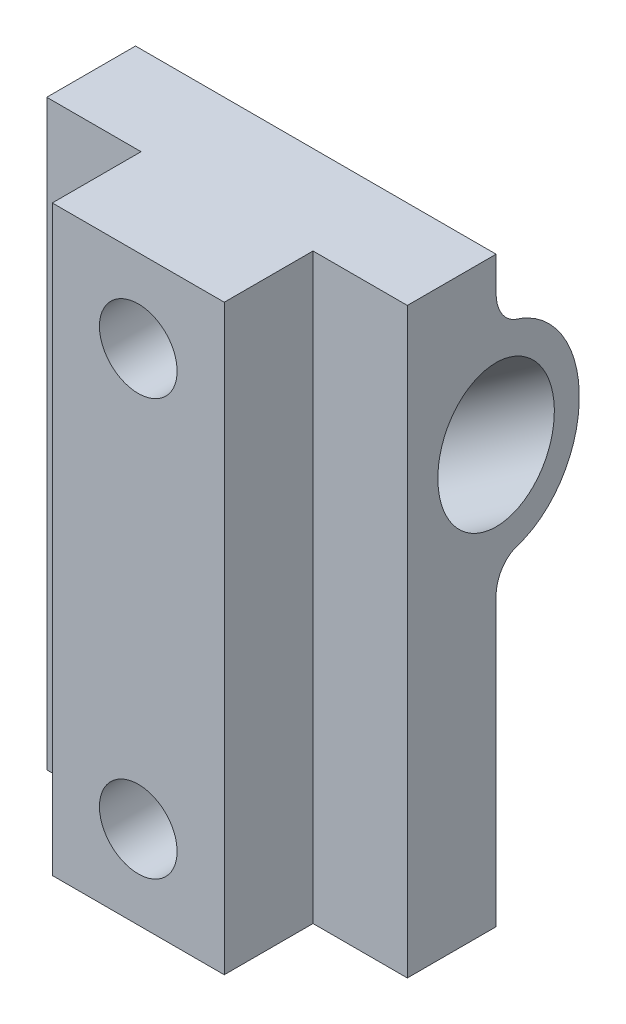
ISO-10303-21;
HEADER;
FILE_DESCRIPTION(('STEP AP214'),'2;1');
FILE_NAME('part.step','',(''),(''),'','','');
FILE_SCHEMA(('AUTOMOTIVE_DESIGN { 1 0 10303 214 1 1 1 1 }'));
ENDSEC;
DATA;
#1=APPLICATION_CONTEXT('core data for automotive mechanical design processes');
#2=APPLICATION_PROTOCOL_DEFINITION('international standard','automotive_design',2000,#1);
#3=PRODUCT_CONTEXT('',#1,'mechanical');
#4=PRODUCT('Part','Part','',(#3));
#5=PRODUCT_RELATED_PRODUCT_CATEGORY('part','',(#4));
#6=PRODUCT_DEFINITION_FORMATION('','',#4);
#7=PRODUCT_DEFINITION_CONTEXT('part definition',#1,'design');
#8=PRODUCT_DEFINITION('design','',#6,#7);
#9=PRODUCT_DEFINITION_SHAPE('','',#8);
#10=(LENGTH_UNIT() NAMED_UNIT(*) SI_UNIT(.MILLI.,.METRE.));
#11=(NAMED_UNIT(*) PLANE_ANGLE_UNIT() SI_UNIT($,.RADIAN.));
#12=(NAMED_UNIT(*) SI_UNIT($,.STERADIAN.) SOLID_ANGLE_UNIT());
#13=UNCERTAINTY_MEASURE_WITH_UNIT(LENGTH_MEASURE(1.E-05),#10,'distance_accuracy_value','');
#14=(GEOMETRIC_REPRESENTATION_CONTEXT(3) GLOBAL_UNCERTAINTY_ASSIGNED_CONTEXT((#13)) GLOBAL_UNIT_ASSIGNED_CONTEXT((#10,
#11,#12)) REPRESENTATION_CONTEXT('',''));
#15=CARTESIAN_POINT('',(0.,0.,0.));
#16=DIRECTION('',(0.,0.,1.));
#17=DIRECTION('',(1.,0.,0.));
#18=AXIS2_PLACEMENT_3D('',#15,#16,#17);
#19=CARTESIAN_POINT('',(0.,105.,-8.));
#20=DIRECTION('',(0.,0.,-1.));
#21=DIRECTION('',(-1.,0.,0.));
#22=AXIS2_PLACEMENT_3D('',#19,#20,#21);
#23=PLANE('',#22);
#24=CARTESIAN_POINT('',(0.,90.,-8.));
#25=DIRECTION('',(0.,0.,-1.));
#26=DIRECTION('',(-1.,0.,0.));
#27=AXIS2_PLACEMENT_3D('',#24,#25,#26);
#28=CIRCLE('',#27,7.);
#29=CARTESIAN_POINT('',(-7.00000000000001,90.,-8.));
#30=VERTEX_POINT('',#29);
#31=EDGE_CURVE('E264',#30,#30,#28,.T.);
#32=ORIENTED_EDGE('',*,*,#31,.F.);
#33=EDGE_LOOP('',(#32));
#34=FACE_BOUND('',#33,.T.);
#35=DIRECTION('',(0.,-1.,0.));
#36=VECTOR('',#35,1.);
#37=CARTESIAN_POINT('',(32.5,105.,-8.));
#38=LINE('',#37,#36);
#39=CARTESIAN_POINT('',(32.5,105.,-8.));
#40=VERTEX_POINT('',#39);
#41=CARTESIAN_POINT('',(32.5,98.8969432505473,-8.));
#42=VERTEX_POINT('',#41);
#43=EDGE_CURVE('E184',#40,#42,#38,.T.);
#44=ORIENTED_EDGE('',*,*,#43,.T.);
#45=DIRECTION('',(0.819152044288991,0.573576436351047,0.));
#46=VECTOR('',#45,1.);
#47=CARTESIAN_POINT('',(13.5596713668071,85.6347823654164,-8.));
#48=LINE('',#47,#46);
#49=CARTESIAN_POINT('',(-32.5,53.383453266916,-7.99999999999999));
#50=VERTEX_POINT('',#49);
#51=EDGE_CURVE('E259',#42,#50,#48,.F.);
#52=ORIENTED_EDGE('',*,*,#51,.T.);
#53=DIRECTION('',(0.,-1.,0.));
#54=VECTOR('',#53,1.);
#55=CARTESIAN_POINT('',(-32.5,105.,-7.99999999999999));
#56=LINE('',#55,#54);
#57=CARTESIAN_POINT('',(-32.5,105.,-7.99999999999999));
#58=VERTEX_POINT('',#57);
#59=EDGE_CURVE('E220',#58,#50,#56,.T.);
#60=ORIENTED_EDGE('',*,*,#59,.F.);
#61=DIRECTION('',(1.,0.,0.));
#62=VECTOR('',#61,1.);
#63=CARTESIAN_POINT('',(0.,105.,-8.));
#64=LINE('',#63,#62);
#65=EDGE_CURVE('E191',#58,#40,#64,.T.);
#66=ORIENTED_EDGE('',*,*,#65,.T.);
#67=EDGE_LOOP('',(#44,#52,#60,#66));
#68=FACE_BOUND('',#67,.T.);
#69=ADVANCED_FACE('F71',(#34,#68),#23,.T.);
#70=CARTESIAN_POINT('',(0.,15.,-8.));
#71=DIRECTION('',(0.,0.,-1.));
#72=DIRECTION('',(1.,0.,0.));
#73=AXIS2_PLACEMENT_3D('',#70,#71,#72);
#74=CIRCLE('',#73,7.);
#75=CARTESIAN_POINT('',(6.99999999999999,15.,-8.));
#76=VERTEX_POINT('',#75);
#77=EDGE_CURVE('E326',#76,#76,#74,.T.);
#78=ORIENTED_EDGE('',*,*,#77,.F.);
#79=EDGE_LOOP('',(#78));
#80=FACE_BOUND('',#79,.T.);
#81=CARTESIAN_POINT('',(-32.5,6.1030567494527,-7.99999999999999));
#82=VERTEX_POINT('',#81);
#83=CARTESIAN_POINT('',(-32.5,0.,-7.99999999999999));
#84=VERTEX_POINT('',#83);
#85=EDGE_CURVE('E219',#82,#84,#56,.T.);
#86=ORIENTED_EDGE('',*,*,#85,.F.);
#87=DIRECTION('',(0.819152044288991,0.573576436351047,0.));
#88=VECTOR('',#87,1.);
#89=CARTESIAN_POINT('',(35.7741912244531,53.9091601099861,-8.00000000000001));
#90=LINE('',#89,#88);
#91=CARTESIAN_POINT('',(32.5,51.616546733084,-8.));
#92=VERTEX_POINT('',#91);
#93=EDGE_CURVE('E277',#82,#92,#90,.T.);
#94=ORIENTED_EDGE('',*,*,#93,.T.);
#95=CARTESIAN_POINT('',(32.5,0.,-8.));
#96=VERTEX_POINT('',#95);
#97=EDGE_CURVE('E224',#92,#96,#38,.T.);
#98=ORIENTED_EDGE('',*,*,#97,.T.);
#99=DIRECTION('',(1.,0.,0.));
#100=VECTOR('',#99,1.);
#101=CARTESIAN_POINT('',(0.,0.,-8.));
#102=LINE('',#101,#100);
#103=EDGE_CURVE('E210',#84,#96,#102,.T.);
#104=ORIENTED_EDGE('',*,*,#103,.F.);
#105=EDGE_LOOP('',(#86,#94,#98,#104));
#106=FACE_BOUND('',#105,.T.);
#107=ADVANCED_FACE('F298',(#80,#106),#23,.T.);
#108=CARTESIAN_POINT('',(32.5,105.,0.));
#109=DIRECTION('',(1.,0.,0.));
#110=DIRECTION('',(0.,0.,-1.));
#111=AXIS2_PLACEMENT_3D('',#108,#109,#110);
#112=PLANE('',#111);
#113=CARTESIAN_POINT('',(32.5,75.2567449918156,-7.99999999999999));
#114=DIRECTION('',(1.,0.,0.));
#115=DIRECTION('',(0.,-1.,0.));
#116=AXIS2_PLACEMENT_3D('',#113,#114,#115);
#117=ELLIPSE('',#116,12.8181331819953,10.5);
#118=CARTESIAN_POINT('',(32.5,62.4386118098203,-8.00000000000001));
#119=VERTEX_POINT('',#118);
#120=EDGE_CURVE('E295',#119,#119,#117,.F.);
#121=ORIENTED_EDGE('',*,*,#120,.T.);
#122=EDGE_LOOP('',(#121));
#123=FACE_BOUND('',#122,.T.);
#124=ORIENTED_EDGE('',*,*,#97,.F.);
#125=CARTESIAN_POINT('',(32.5,51.616546733084,-13.));
#126=DIRECTION('',(1.,0.,0.));
#127=DIRECTION('',(0.,1.,0.));
#128=AXIS2_PLACEMENT_3D('',#125,#126,#127);
#129=ELLIPSE('',#128,6.10387294380729,5.);
#130=CARTESIAN_POINT('',(32.5,57.5265962977669,-11.75));
#131=VERTEX_POINT('',#130);
#132=EDGE_CURVE('E80',#92,#131,#129,.F.);
#133=ORIENTED_EDGE('',*,*,#132,.T.);
#134=CARTESIAN_POINT('',(32.5,75.2567449918156,-7.99999999999999));
#135=DIRECTION('',(1.,0.,0.));
#136=DIRECTION('',(0.,-1.,0.));
#137=AXIS2_PLACEMENT_3D('',#134,#135,#136);
#138=ELLIPSE('',#137,18.3116188314219,15.);
#139=CARTESIAN_POINT('',(32.5,92.9868936858644,-11.75));
#140=VERTEX_POINT('',#139);
#141=EDGE_CURVE('E288',#140,#131,#138,.F.);
#142=ORIENTED_EDGE('',*,*,#141,.F.);
#143=CARTESIAN_POINT('',(32.5,98.8969432505473,-13.));
#144=DIRECTION('',(1.,0.,0.));
#145=DIRECTION('',(0.,1.,0.));
#146=AXIS2_PLACEMENT_3D('',#143,#144,#145);
#147=ELLIPSE('',#146,6.10387294380729,5.);
#148=EDGE_CURVE('E283',#140,#42,#147,.F.);
#149=ORIENTED_EDGE('',*,*,#148,.T.);
#150=ORIENTED_EDGE('',*,*,#43,.F.);
#151=DIRECTION('',(0.,0.,1.));
#152=VECTOR('',#151,1.);
#153=CARTESIAN_POINT('',(32.5,105.,0.));
#154=LINE('',#153,#152);
#155=CARTESIAN_POINT('',(32.5,105.,8.));
#156=VERTEX_POINT('',#155);
#157=EDGE_CURVE('E166',#40,#156,#154,.T.);
#158=ORIENTED_EDGE('',*,*,#157,.T.);
#159=DIRECTION('',(0.,-1.,0.));
#160=VECTOR('',#159,1.);
#161=CARTESIAN_POINT('',(32.5,105.,8.));
#162=LINE('',#161,#160);
#163=CARTESIAN_POINT('',(32.5,0.,8.));
#164=VERTEX_POINT('',#163);
#165=EDGE_CURVE('E175',#156,#164,#162,.T.);
#166=ORIENTED_EDGE('',*,*,#165,.T.);
#167=DIRECTION('',(0.,0.,1.));
#168=VECTOR('',#167,1.);
#169=CARTESIAN_POINT('',(32.5,0.,0.));
#170=LINE('',#169,#168);
#171=EDGE_CURVE('E207',#96,#164,#170,.T.);
#172=ORIENTED_EDGE('',*,*,#171,.F.);
#173=EDGE_LOOP('',(#124,#133,#142,#149,#150,#158,#166,#172));
#174=FACE_BOUND('',#173,.T.);
#175=ADVANCED_FACE('F188',(#123,#174),#112,.T.);
#176=CARTESIAN_POINT('',(0.,105.,8.));
#177=DIRECTION('',(0.,0.,-1.));
#178=DIRECTION('',(-1.,0.,0.));
#179=AXIS2_PLACEMENT_3D('',#176,#177,#178);
#180=PLANE('',#179);
#181=DIRECTION('',(1.,0.,0.));
#182=VECTOR('',#181,1.);
#183=CARTESIAN_POINT('',(0.,105.,8.));
#184=LINE('',#183,#182);
#185=CARTESIAN_POINT('',(15.5,105.,8.));
#186=VERTEX_POINT('',#185);
#187=EDGE_CURVE('E161',#186,#156,#184,.T.);
#188=ORIENTED_EDGE('',*,*,#187,.F.);
#189=DIRECTION('',(0.,-1.,0.));
#190=VECTOR('',#189,1.);
#191=CARTESIAN_POINT('',(15.5,105.,8.));
#192=LINE('',#191,#190);
#193=CARTESIAN_POINT('',(15.5,0.,8.));
#194=VERTEX_POINT('',#193);
#195=EDGE_CURVE('E183',#186,#194,#192,.T.);
#196=ORIENTED_EDGE('',*,*,#195,.T.);
#197=DIRECTION('',(1.,0.,0.));
#198=VECTOR('',#197,1.);
#199=CARTESIAN_POINT('',(0.,0.,8.));
#200=LINE('',#199,#198);
#201=EDGE_CURVE('E178',#194,#164,#200,.T.);
#202=ORIENTED_EDGE('',*,*,#201,.T.);
#203=ORIENTED_EDGE('',*,*,#165,.F.);
#204=EDGE_LOOP('',(#188,#196,#202,#203));
#205=FACE_BOUND('',#204,.T.);
#206=ADVANCED_FACE('F176',(#205),#180,.F.);
#207=CARTESIAN_POINT('',(0.,0.,0.));
#208=DIRECTION('',(0.,1.,0.));
#209=DIRECTION('',(0.,0.,1.));
#210=AXIS2_PLACEMENT_3D('',#207,#208,#209);
#211=PLANE('',#210);
#212=ORIENTED_EDGE('',*,*,#201,.F.);
#213=DIRECTION('',(0.,0.,1.));
#214=VECTOR('',#213,1.);
#215=CARTESIAN_POINT('',(15.5,0.,-8.));
#216=LINE('',#215,#214);
#217=CARTESIAN_POINT('',(15.5,0.,24.));
#218=VERTEX_POINT('',#217);
#219=EDGE_CURVE('E231',#194,#218,#216,.T.);
#220=ORIENTED_EDGE('',*,*,#219,.T.);
#221=DIRECTION('',(1.,0.,0.));
#222=VECTOR('',#221,1.);
#223=CARTESIAN_POINT('',(-15.5,0.,24.));
#224=LINE('',#223,#222);
#225=CARTESIAN_POINT('',(-15.5,0.,24.));
#226=VERTEX_POINT('',#225);
#227=EDGE_CURVE('E240',#226,#218,#224,.T.);
#228=ORIENTED_EDGE('',*,*,#227,.F.);
#229=DIRECTION('',(0.,0.,1.));
#230=VECTOR('',#229,1.);
#231=CARTESIAN_POINT('',(-15.5,0.,-8.));
#232=LINE('',#231,#230);
#233=CARTESIAN_POINT('',(-15.5,0.,8.00000000000001));
#234=VERTEX_POINT('',#233);
#235=EDGE_CURVE('E237',#234,#226,#232,.T.);
#236=ORIENTED_EDGE('',*,*,#235,.F.);
#237=CARTESIAN_POINT('',(-32.5,0.,8.00000000000001));
#238=VERTEX_POINT('',#237);
#239=EDGE_CURVE('E203',#238,#234,#200,.T.);
#240=ORIENTED_EDGE('',*,*,#239,.F.);
#241=DIRECTION('',(0.,0.,1.));
#242=VECTOR('',#241,1.);
#243=CARTESIAN_POINT('',(-32.5,0.,0.));
#244=LINE('',#243,#242);
#245=EDGE_CURVE('E172',#84,#238,#244,.T.);
#246=ORIENTED_EDGE('',*,*,#245,.F.);
#247=ORIENTED_EDGE('',*,*,#103,.T.);
#248=ORIENTED_EDGE('',*,*,#171,.T.);
#249=EDGE_LOOP('',(#212,#220,#228,#236,#240,#246,#247,#248));
#250=FACE_BOUND('',#249,.T.);
#251=ADVANCED_FACE('F307',(#250),#211,.F.);
#252=CARTESIAN_POINT('',(0.,105.,0.));
#253=DIRECTION('',(0.,1.,0.));
#254=DIRECTION('',(0.,0.,1.));
#255=AXIS2_PLACEMENT_3D('',#252,#253,#254);
#256=PLANE('',#255);
#257=ORIENTED_EDGE('',*,*,#157,.F.);
#258=ORIENTED_EDGE('',*,*,#65,.F.);
#259=DIRECTION('',(0.,0.,1.));
#260=VECTOR('',#259,1.);
#261=CARTESIAN_POINT('',(-32.5,105.,0.));
#262=LINE('',#261,#260);
#263=CARTESIAN_POINT('',(-32.5,105.,8.00000000000001));
#264=VERTEX_POINT('',#263);
#265=EDGE_CURVE('E195',#58,#264,#262,.T.);
#266=ORIENTED_EDGE('',*,*,#265,.T.);
#267=CARTESIAN_POINT('',(-15.5,105.,8.00000000000001));
#268=VERTEX_POINT('',#267);
#269=EDGE_CURVE('E171',#264,#268,#184,.T.);
#270=ORIENTED_EDGE('',*,*,#269,.T.);
#271=DIRECTION('',(0.,0.,1.));
#272=VECTOR('',#271,1.);
#273=CARTESIAN_POINT('',(-15.5,105.,-8.));
#274=LINE('',#273,#272);
#275=CARTESIAN_POINT('',(-15.5,105.,24.));
#276=VERTEX_POINT('',#275);
#277=EDGE_CURVE('E227',#268,#276,#274,.T.);
#278=ORIENTED_EDGE('',*,*,#277,.T.);
#279=DIRECTION('',(1.,0.,0.));
#280=VECTOR('',#279,1.);
#281=CARTESIAN_POINT('',(-15.5,105.,24.));
#282=LINE('',#281,#280);
#283=CARTESIAN_POINT('',(15.5,105.,24.));
#284=VERTEX_POINT('',#283);
#285=EDGE_CURVE('E230',#276,#284,#282,.T.);
#286=ORIENTED_EDGE('',*,*,#285,.T.);
#287=DIRECTION('',(0.,0.,1.));
#288=VECTOR('',#287,1.);
#289=CARTESIAN_POINT('',(15.5,105.,-8.));
#290=LINE('',#289,#288);
#291=EDGE_CURVE('E168',#186,#284,#290,.T.);
#292=ORIENTED_EDGE('',*,*,#291,.F.);
#293=ORIENTED_EDGE('',*,*,#187,.T.);
#294=EDGE_LOOP('',(#257,#258,#266,#270,#278,#286,#292,#293));
#295=FACE_BOUND('',#294,.T.);
#296=ADVANCED_FACE('F163',(#295),#256,.T.);
#297=CARTESIAN_POINT('',(-32.5,105.,0.));
#298=DIRECTION('',(1.,0.,0.));
#299=DIRECTION('',(0.,0.,-1.));
#300=AXIS2_PLACEMENT_3D('',#297,#298,#299);
#301=PLANE('',#300);
#302=CARTESIAN_POINT('',(-32.5,29.7432550081844,-7.99999999999999));
#303=DIRECTION('',(1.,0.,0.));
#304=DIRECTION('',(0.,1.,0.));
#305=AXIS2_PLACEMENT_3D('',#302,#303,#304);
#306=ELLIPSE('',#305,12.8181331819953,10.5);
#307=CARTESIAN_POINT('',(-32.5,42.5613881901797,-7.99999999999999));
#308=VERTEX_POINT('',#307);
#309=EDGE_CURVE('E321',#308,#308,#306,.T.);
#310=ORIENTED_EDGE('',*,*,#309,.T.);
#311=EDGE_LOOP('',(#310));
#312=FACE_BOUND('',#311,.T.);
#313=ORIENTED_EDGE('',*,*,#59,.T.);
#314=CARTESIAN_POINT('',(-32.5,53.383453266916,-13.));
#315=DIRECTION('',(1.,0.,0.));
#316=DIRECTION('',(0.,1.,0.));
#317=AXIS2_PLACEMENT_3D('',#314,#315,#316);
#318=ELLIPSE('',#317,6.10387294380729,5.);
#319=CARTESIAN_POINT('',(-32.5,47.4734037022331,-11.75));
#320=VERTEX_POINT('',#319);
#321=EDGE_CURVE('E280',#50,#320,#318,.T.);
#322=ORIENTED_EDGE('',*,*,#321,.T.);
#323=CARTESIAN_POINT('',(-32.5,29.7432550081844,-7.99999999999999));
#324=DIRECTION('',(1.,0.,0.));
#325=DIRECTION('',(0.,1.,0.));
#326=AXIS2_PLACEMENT_3D('',#323,#324,#325);
#327=ELLIPSE('',#326,18.3116188314219,15.);
#328=CARTESIAN_POINT('',(-32.5,12.0131063141356,-11.75));
#329=VERTEX_POINT('',#328);
#330=EDGE_CURVE('E319',#329,#320,#327,.T.);
#331=ORIENTED_EDGE('',*,*,#330,.F.);
#332=CARTESIAN_POINT('',(-32.5,6.10305674945269,-13.));
#333=DIRECTION('',(1.,0.,0.));
#334=DIRECTION('',(0.,1.,0.));
#335=AXIS2_PLACEMENT_3D('',#332,#333,#334);
#336=ELLIPSE('',#335,6.10387294380729,5.);
#337=EDGE_CURVE('E12',#329,#82,#336,.T.);
#338=ORIENTED_EDGE('',*,*,#337,.T.);
#339=ORIENTED_EDGE('',*,*,#85,.T.);
#340=ORIENTED_EDGE('',*,*,#245,.T.);
#341=DIRECTION('',(0.,-1.,0.));
#342=VECTOR('',#341,1.);
#343=CARTESIAN_POINT('',(-32.5,105.,8.00000000000001));
#344=LINE('',#343,#342);
#345=EDGE_CURVE('E202',#264,#238,#344,.T.);
#346=ORIENTED_EDGE('',*,*,#345,.F.);
#347=ORIENTED_EDGE('',*,*,#265,.F.);
#348=EDGE_LOOP('',(#313,#322,#331,#338,#339,#340,#346,#347));
#349=FACE_BOUND('',#348,.T.);
#350=ADVANCED_FACE('F303',(#312,#349),#301,.F.);
#351=DIRECTION('',(0.,-1.,0.));
#352=VECTOR('',#351,1.);
#353=CARTESIAN_POINT('',(-15.5,105.,8.00000000000001));
#354=LINE('',#353,#352);
#355=EDGE_CURVE('E256',#268,#234,#354,.T.);
#356=ORIENTED_EDGE('',*,*,#355,.F.);
#357=ORIENTED_EDGE('',*,*,#269,.F.);
#358=ORIENTED_EDGE('',*,*,#345,.T.);
#359=ORIENTED_EDGE('',*,*,#239,.T.);
#360=EDGE_LOOP('',(#356,#357,#358,#359));
#361=FACE_BOUND('',#360,.T.);
#362=ADVANCED_FACE('F311',(#361),#180,.F.);
#363=CARTESIAN_POINT('',(-15.5,105.,24.));
#364=DIRECTION('',(0.,0.,-1.));
#365=DIRECTION('',(-1.,0.,0.));
#366=AXIS2_PLACEMENT_3D('',#363,#364,#365);
#367=PLANE('',#366);
#368=CARTESIAN_POINT('',(0.,90.,24.));
#369=DIRECTION('',(0.,0.,-1.));
#370=DIRECTION('',(-1.,0.,0.));
#371=AXIS2_PLACEMENT_3D('',#368,#369,#370);
#372=CIRCLE('',#371,7.);
#373=CARTESIAN_POINT('',(-7.,90.,24.));
#374=VERTEX_POINT('',#373);
#375=EDGE_CURVE('E241',#374,#374,#372,.T.);
#376=ORIENTED_EDGE('',*,*,#375,.T.);
#377=EDGE_LOOP('',(#376));
#378=FACE_BOUND('',#377,.T.);
#379=CARTESIAN_POINT('',(0.,15.,24.));
#380=DIRECTION('',(0.,0.,-1.));
#381=DIRECTION('',(-1.,0.,0.));
#382=AXIS2_PLACEMENT_3D('',#379,#380,#381);
#383=CIRCLE('',#382,7.);
#384=CARTESIAN_POINT('',(-7.00000000000001,15.,24.));
#385=VERTEX_POINT('',#384);
#386=EDGE_CURVE('E260',#385,#385,#383,.T.);
#387=ORIENTED_EDGE('',*,*,#386,.T.);
#388=EDGE_LOOP('',(#387));
#389=FACE_BOUND('',#388,.T.);
#390=ORIENTED_EDGE('',*,*,#227,.T.);
#391=DIRECTION('',(0.,-1.,0.));
#392=VECTOR('',#391,1.);
#393=CARTESIAN_POINT('',(15.5,105.,24.));
#394=LINE('',#393,#392);
#395=EDGE_CURVE('E236',#284,#218,#394,.T.);
#396=ORIENTED_EDGE('',*,*,#395,.F.);
#397=ORIENTED_EDGE('',*,*,#285,.F.);
#398=DIRECTION('',(0.,-1.,0.));
#399=VECTOR('',#398,1.);
#400=CARTESIAN_POINT('',(-15.5,105.,24.));
#401=LINE('',#400,#399);
#402=EDGE_CURVE('E250',#276,#226,#401,.T.);
#403=ORIENTED_EDGE('',*,*,#402,.T.);
#404=EDGE_LOOP('',(#390,#396,#397,#403));
#405=FACE_BOUND('',#404,.T.);
#406=ADVANCED_FACE('F358',(#378,#389,#405),#367,.F.);
#407=CARTESIAN_POINT('',(15.5,105.,-8.));
#408=DIRECTION('',(1.,0.,0.));
#409=DIRECTION('',(0.,0.,-1.));
#410=AXIS2_PLACEMENT_3D('',#407,#408,#409);
#411=PLANE('',#410);
#412=ORIENTED_EDGE('',*,*,#195,.F.);
#413=ORIENTED_EDGE('',*,*,#291,.T.);
#414=ORIENTED_EDGE('',*,*,#395,.T.);
#415=ORIENTED_EDGE('',*,*,#219,.F.);
#416=EDGE_LOOP('',(#412,#413,#414,#415));
#417=FACE_BOUND('',#416,.T.);
#418=ADVANCED_FACE('F354',(#417),#411,.T.);
#419=CARTESIAN_POINT('',(-15.5,105.,-8.));
#420=DIRECTION('',(1.,0.,0.));
#421=DIRECTION('',(0.,0.,-1.));
#422=AXIS2_PLACEMENT_3D('',#419,#420,#421);
#423=PLANE('',#422);
#424=ORIENTED_EDGE('',*,*,#277,.F.);
#425=ORIENTED_EDGE('',*,*,#355,.T.);
#426=ORIENTED_EDGE('',*,*,#235,.T.);
#427=ORIENTED_EDGE('',*,*,#402,.F.);
#428=EDGE_LOOP('',(#424,#425,#426,#427));
#429=FACE_BOUND('',#428,.T.);
#430=ADVANCED_FACE('F357',(#429),#423,.F.);
#431=CARTESIAN_POINT('',(0.,15.,97.));
#432=DIRECTION('',(0.,0.,-1.));
#433=DIRECTION('',(-1.,0.,0.));
#434=AXIS2_PLACEMENT_3D('',#431,#432,#433);
#435=CYLINDRICAL_SURFACE('',#434,7.);
#436=ORIENTED_EDGE('',*,*,#77,.T.);
#437=EDGE_LOOP('',(#436));
#438=FACE_BOUND('',#437,.T.);
#439=ORIENTED_EDGE('',*,*,#386,.F.);
#440=EDGE_LOOP('',(#439));
#441=FACE_BOUND('',#440,.T.);
#442=ADVANCED_FACE('F337',(#438,#441),#435,.F.);
#443=CARTESIAN_POINT('',(0.,90.,97.));
#444=DIRECTION('',(0.,0.,-1.));
#445=DIRECTION('',(-1.,0.,0.));
#446=AXIS2_PLACEMENT_3D('',#443,#444,#445);
#447=CYLINDRICAL_SURFACE('',#446,7.);
#448=ORIENTED_EDGE('',*,*,#31,.T.);
#449=EDGE_LOOP('',(#448));
#450=FACE_BOUND('',#449,.T.);
#451=ORIENTED_EDGE('',*,*,#375,.F.);
#452=EDGE_LOOP('',(#451));
#453=FACE_BOUND('',#452,.T.);
#454=ADVANCED_FACE('F376',(#450,#453),#447,.F.);
#455=CARTESIAN_POINT('',(-71.0900423957835,2.7222164228244,-7.99999999999999));
#456=DIRECTION('',(0.819152044288991,0.573576436351047,0.));
#457=DIRECTION('',(-0.573576436351047,0.819152044288991,0.));
#458=AXIS2_PLACEMENT_3D('',#455,#456,#457);
#459=CYLINDRICAL_SURFACE('',#458,15.);
#460=ORIENTED_EDGE('',*,*,#330,.T.);
#461=DIRECTION('',(0.819152044288991,0.573576436351047,0.));
#462=VECTOR('',#461,1.);
#463=CARTESIAN_POINT('',(-79.4204873424007,14.6193247686107,-11.75));
#464=LINE('',#463,#462);
#465=EDGE_CURVE('E274',#320,#140,#464,.T.);
#466=ORIENTED_EDGE('',*,*,#465,.T.);
#467=ORIENTED_EDGE('',*,*,#141,.T.);
#468=DIRECTION('',(0.819152044288991,0.573576436351047,0.));
#469=VECTOR('',#468,1.);
#470=CARTESIAN_POINT('',(-62.7595974491662,-9.17489192296194,-11.75));
#471=LINE('',#470,#469);
#472=EDGE_CURVE('E271',#131,#329,#471,.F.);
#473=ORIENTED_EDGE('',*,*,#472,.T.);
#474=EDGE_LOOP('',(#460,#466,#467,#473));
#475=FACE_BOUND('',#474,.T.);
#476=ADVANCED_FACE('F292',(#475),#459,.T.);
#477=CARTESIAN_POINT('',(-71.0900423957835,2.7222164228244,-7.99999999999999));
#478=DIRECTION('',(0.819152044288991,0.573576436351047,0.));
#479=DIRECTION('',(-0.573576436351047,0.819152044288991,0.));
#480=AXIS2_PLACEMENT_3D('',#477,#478,#479);
#481=CYLINDRICAL_SURFACE('',#480,10.5);
#482=ORIENTED_EDGE('',*,*,#120,.F.);
#483=EDGE_LOOP('',(#482));
#484=FACE_BOUND('',#483,.T.);
#485=ORIENTED_EDGE('',*,*,#309,.F.);
#486=EDGE_LOOP('',(#485));
#487=FACE_BOUND('',#486,.T.);
#488=ADVANCED_FACE('F366',(#484,#487),#481,.F.);
#489=CARTESIAN_POINT('',(-82.1973023246065,18.5850275505395,-13.));
#490=DIRECTION('',(0.819152044288991,0.573576436351047,0.));
#491=DIRECTION('',(-0.573576436351047,0.819152044288991,0.));
#492=AXIS2_PLACEMENT_3D('',#489,#490,#491);
#493=CYLINDRICAL_SURFACE('',#492,5.);
#494=ORIENTED_EDGE('',*,*,#148,.F.);
#495=ORIENTED_EDGE('',*,*,#465,.F.);
#496=ORIENTED_EDGE('',*,*,#321,.F.);
#497=ORIENTED_EDGE('',*,*,#51,.F.);
#498=EDGE_LOOP('',(#494,#495,#496,#497));
#499=FACE_BOUND('',#498,.T.);
#500=ADVANCED_FACE('F318',(#499),#493,.F.);
#501=CARTESIAN_POINT('',(-59.9827824669605,-13.1405947048907,-13.));
#502=DIRECTION('',(0.819152044288991,0.573576436351047,0.));
#503=DIRECTION('',(-0.573576436351047,0.819152044288991,0.));
#504=AXIS2_PLACEMENT_3D('',#501,#502,#503);
#505=CYLINDRICAL_SURFACE('',#504,5.);
#506=ORIENTED_EDGE('',*,*,#337,.F.);
#507=ORIENTED_EDGE('',*,*,#472,.F.);
#508=ORIENTED_EDGE('',*,*,#132,.F.);
#509=ORIENTED_EDGE('',*,*,#93,.F.);
#510=EDGE_LOOP('',(#506,#507,#508,#509));
#511=FACE_BOUND('',#510,.T.);
#512=ADVANCED_FACE('F73',(#511),#505,.F.);
#513=CLOSED_SHELL('',(#69,#107,#175,#206,#251,#296,#350,#362,#406,#418,#430,#442,#454,#476,#488,
#500,#512));
#514=MANIFOLD_SOLID_BREP('B2',#513);
#515=ADVANCED_BREP_SHAPE_REPRESENTATION('',(#18,#514),#14);
#516=SHAPE_DEFINITION_REPRESENTATION(#9,#515);
ENDSEC;
END-ISO-10303-21;
